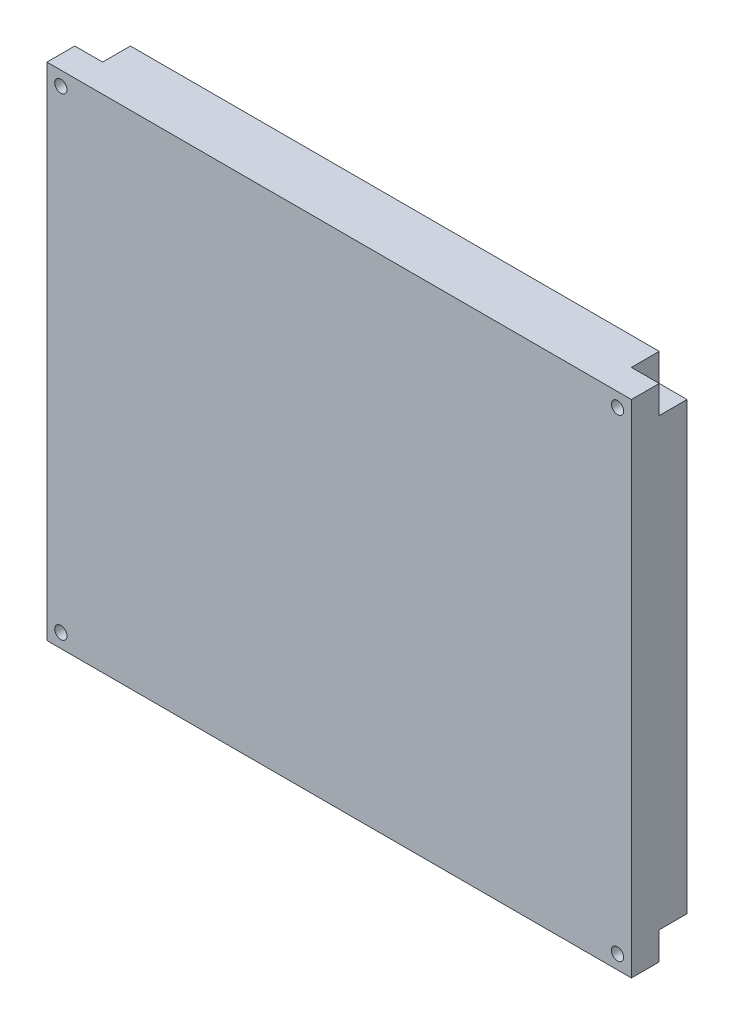
ISO-10303-21;
HEADER;
FILE_DESCRIPTION(('STEP AP214'),'2;1');
FILE_NAME('part.step','',(''),(''),'','','');
FILE_SCHEMA(('AUTOMOTIVE_DESIGN { 1 0 10303 214 1 1 1 1 }'));
ENDSEC;
DATA;
#1=APPLICATION_CONTEXT('core data for automotive mechanical design processes');
#2=APPLICATION_PROTOCOL_DEFINITION('international standard','automotive_design',2000,#1);
#3=PRODUCT_CONTEXT('',#1,'mechanical');
#4=PRODUCT('Part','Part','',(#3));
#5=PRODUCT_RELATED_PRODUCT_CATEGORY('part','',(#4));
#6=PRODUCT_DEFINITION_FORMATION('','',#4);
#7=PRODUCT_DEFINITION_CONTEXT('part definition',#1,'design');
#8=PRODUCT_DEFINITION('design','',#6,#7);
#9=PRODUCT_DEFINITION_SHAPE('','',#8);
#10=(LENGTH_UNIT() NAMED_UNIT(*) SI_UNIT(.MILLI.,.METRE.));
#11=(NAMED_UNIT(*) PLANE_ANGLE_UNIT() SI_UNIT($,.RADIAN.));
#12=(NAMED_UNIT(*) SI_UNIT($,.STERADIAN.) SOLID_ANGLE_UNIT());
#13=UNCERTAINTY_MEASURE_WITH_UNIT(LENGTH_MEASURE(1.E-05),#10,'distance_accuracy_value','');
#14=(GEOMETRIC_REPRESENTATION_CONTEXT(3) GLOBAL_UNCERTAINTY_ASSIGNED_CONTEXT((#13)) GLOBAL_UNIT_ASSIGNED_CONTEXT((#10,
#11,#12)) REPRESENTATION_CONTEXT('',''));
#15=CARTESIAN_POINT('',(0.,0.,0.));
#16=DIRECTION('',(0.,0.,1.));
#17=DIRECTION('',(1.,0.,0.));
#18=AXIS2_PLACEMENT_3D('',#15,#16,#17);
#19=CARTESIAN_POINT('',(-59.0384615384616,29.8076923076923,10.));
#20=DIRECTION('',(1.,0.,0.));
#21=DIRECTION('',(0.,1.,0.));
#22=AXIS2_PLACEMENT_3D('',#19,#20,#21);
#23=PLANE('',#22);
#24=DIRECTION('',(0.,0.,-1.));
#25=VECTOR('',#24,1.);
#26=CARTESIAN_POINT('',(-59.0384615384616,24.8076923076923,5.));
#27=LINE('',#26,#25);
#28=CARTESIAN_POINT('',(-59.0384615384616,24.8076923076923,5.));
#29=VERTEX_POINT('',#28);
#30=CARTESIAN_POINT('',(-59.0384615384616,24.8076923076923,0.));
#31=VERTEX_POINT('',#30);
#32=EDGE_CURVE('E258',#29,#31,#27,.T.);
#33=ORIENTED_EDGE('',*,*,#32,.T.);
#34=DIRECTION('',(0.,-1.,0.));
#35=VECTOR('',#34,1.);
#36=CARTESIAN_POINT('',(-59.0384615384616,29.8076923076923,0.));
#37=LINE('',#36,#35);
#38=CARTESIAN_POINT('',(-59.0384615384615,-55.1923076923077,0.));
#39=VERTEX_POINT('',#38);
#40=EDGE_CURVE('E330',#31,#39,#37,.T.);
#41=ORIENTED_EDGE('',*,*,#40,.T.);
#42=DIRECTION('',(0.,0.,-1.));
#43=VECTOR('',#42,1.);
#44=CARTESIAN_POINT('',(-59.0384615384615,-55.1923076923077,5.));
#45=LINE('',#44,#43);
#46=CARTESIAN_POINT('',(-59.0384615384615,-55.1923076923077,5.));
#47=VERTEX_POINT('',#46);
#48=EDGE_CURVE('E314',#47,#39,#45,.T.);
#49=ORIENTED_EDGE('',*,*,#48,.F.);
#50=DIRECTION('',(0.,-1.,0.));
#51=VECTOR('',#50,1.);
#52=CARTESIAN_POINT('',(-59.0384615384615,-60.1923076923077,5.));
#53=LINE('',#52,#51);
#54=CARTESIAN_POINT('',(-59.0384615384615,-60.1923076923077,5.));
#55=VERTEX_POINT('',#54);
#56=EDGE_CURVE('E299',#47,#55,#53,.T.);
#57=ORIENTED_EDGE('',*,*,#56,.T.);
#58=DIRECTION('',(0.,0.,-1.));
#59=VECTOR('',#58,1.);
#60=CARTESIAN_POINT('',(-59.0384615384615,-60.1923076923077,10.));
#61=LINE('',#60,#59);
#62=CARTESIAN_POINT('',(-59.0384615384615,-60.1923076923077,10.));
#63=VERTEX_POINT('',#62);
#64=EDGE_CURVE('E11',#63,#55,#61,.T.);
#65=ORIENTED_EDGE('',*,*,#64,.F.);
#66=DIRECTION('',(0.,-1.,0.));
#67=VECTOR('',#66,1.);
#68=CARTESIAN_POINT('',(-59.0384615384616,29.8076923076923,10.));
#69=LINE('',#68,#67);
#70=CARTESIAN_POINT('',(-59.0384615384616,29.8076923076923,10.));
#71=VERTEX_POINT('',#70);
#72=EDGE_CURVE('E331',#71,#63,#69,.T.);
#73=ORIENTED_EDGE('',*,*,#72,.F.);
#74=DIRECTION('',(0.,0.,-1.));
#75=VECTOR('',#74,1.);
#76=CARTESIAN_POINT('',(-59.0384615384616,29.8076923076923,10.));
#77=LINE('',#76,#75);
#78=CARTESIAN_POINT('',(-59.0384615384616,29.8076923076923,5.));
#79=VERTEX_POINT('',#78);
#80=EDGE_CURVE('E184',#71,#79,#77,.T.);
#81=ORIENTED_EDGE('',*,*,#80,.T.);
#82=DIRECTION('',(0.,-1.,0.));
#83=VECTOR('',#82,1.);
#84=CARTESIAN_POINT('',(-59.0384615384616,29.8076923076923,5.));
#85=LINE('',#84,#83);
#86=EDGE_CURVE('E269',#79,#29,#85,.T.);
#87=ORIENTED_EDGE('',*,*,#86,.T.);
#88=EDGE_LOOP('',(#33,#41,#49,#57,#65,#73,#81,#87));
#89=FACE_BOUND('',#88,.T.);
#90=ADVANCED_FACE('F39',(#89),#23,.F.);
#91=CARTESIAN_POINT('',(-59.0384615384615,-60.1923076923077,10.));
#92=DIRECTION('',(0.,1.,0.));
#93=DIRECTION('',(0.,0.,1.));
#94=AXIS2_PLACEMENT_3D('',#91,#92,#93);
#95=PLANE('',#94);
#96=DIRECTION('',(0.,0.,-1.));
#97=VECTOR('',#96,1.);
#98=CARTESIAN_POINT('',(40.9615384615385,-60.1923076923077,5.));
#99=LINE('',#98,#97);
#100=CARTESIAN_POINT('',(40.9615384615385,-60.1923076923077,5.));
#101=VERTEX_POINT('',#100);
#102=CARTESIAN_POINT('',(40.9615384615385,-60.1923076923077,0.));
#103=VERTEX_POINT('',#102);
#104=EDGE_CURVE('E56',#101,#103,#99,.T.);
#105=ORIENTED_EDGE('',*,*,#104,.F.);
#106=DIRECTION('',(1.,0.,0.));
#107=VECTOR('',#106,1.);
#108=CARTESIAN_POINT('',(45.9615384615385,-60.1923076923077,5.));
#109=LINE('',#108,#107);
#110=CARTESIAN_POINT('',(45.9615384615385,-60.1923076923077,5.));
#111=VERTEX_POINT('',#110);
#112=EDGE_CURVE('E161',#101,#111,#109,.T.);
#113=ORIENTED_EDGE('',*,*,#112,.T.);
#114=DIRECTION('',(0.,0.,-1.));
#115=VECTOR('',#114,1.);
#116=CARTESIAN_POINT('',(45.9615384615385,-60.1923076923077,10.));
#117=LINE('',#116,#115);
#118=CARTESIAN_POINT('',(45.9615384615385,-60.1923076923077,10.));
#119=VERTEX_POINT('',#118);
#120=EDGE_CURVE('E48',#119,#111,#117,.T.);
#121=ORIENTED_EDGE('',*,*,#120,.F.);
#122=DIRECTION('',(1.,0.,0.));
#123=VECTOR('',#122,1.);
#124=CARTESIAN_POINT('',(-59.0384615384615,-60.1923076923077,10.));
#125=LINE('',#124,#123);
#126=EDGE_CURVE('E335',#63,#119,#125,.T.);
#127=ORIENTED_EDGE('',*,*,#126,.F.);
#128=ORIENTED_EDGE('',*,*,#64,.T.);
#129=DIRECTION('',(1.,0.,0.));
#130=VECTOR('',#129,1.);
#131=CARTESIAN_POINT('',(-59.0384615384615,-60.1923076923077,5.));
#132=LINE('',#131,#130);
#133=CARTESIAN_POINT('',(-54.0384615384615,-60.1923076923077,5.));
#134=VERTEX_POINT('',#133);
#135=EDGE_CURVE('E303',#55,#134,#132,.T.);
#136=ORIENTED_EDGE('',*,*,#135,.T.);
#137=DIRECTION('',(0.,0.,-1.));
#138=VECTOR('',#137,1.);
#139=CARTESIAN_POINT('',(-54.0384615384615,-60.1923076923077,5.));
#140=LINE('',#139,#138);
#141=CARTESIAN_POINT('',(-54.0384615384615,-60.1923076923077,0.));
#142=VERTEX_POINT('',#141);
#143=EDGE_CURVE('E326',#134,#142,#140,.T.);
#144=ORIENTED_EDGE('',*,*,#143,.T.);
#145=DIRECTION('',(1.,0.,0.));
#146=VECTOR('',#145,1.);
#147=CARTESIAN_POINT('',(-59.0384615384615,-60.1923076923077,0.));
#148=LINE('',#147,#146);
#149=EDGE_CURVE('E347',#142,#103,#148,.T.);
#150=ORIENTED_EDGE('',*,*,#149,.T.);
#151=EDGE_LOOP('',(#105,#113,#121,#127,#128,#136,#144,#150));
#152=FACE_BOUND('',#151,.T.);
#153=ADVANCED_FACE('F170',(#152),#95,.F.);
#154=CARTESIAN_POINT('',(45.9615384615384,29.8076923076923,10.));
#155=DIRECTION('',(-1.,0.,0.));
#156=DIRECTION('',(0.,-1.,0.));
#157=AXIS2_PLACEMENT_3D('',#154,#155,#156);
#158=PLANE('',#157);
#159=DIRECTION('',(0.,0.,-1.));
#160=VECTOR('',#159,1.);
#161=CARTESIAN_POINT('',(45.9615384615384,24.8076923076923,5.));
#162=LINE('',#161,#160);
#163=CARTESIAN_POINT('',(45.9615384615384,24.8076923076923,5.));
#164=VERTEX_POINT('',#163);
#165=CARTESIAN_POINT('',(45.9615384615384,24.8076923076923,0.));
#166=VERTEX_POINT('',#165);
#167=EDGE_CURVE('E64',#164,#166,#162,.T.);
#168=ORIENTED_EDGE('',*,*,#167,.F.);
#169=DIRECTION('',(0.,1.,0.));
#170=VECTOR('',#169,1.);
#171=CARTESIAN_POINT('',(45.9615384615384,29.8076923076923,5.));
#172=LINE('',#171,#170);
#173=CARTESIAN_POINT('',(45.9615384615384,29.8076923076923,5.));
#174=VERTEX_POINT('',#173);
#175=EDGE_CURVE('E239',#164,#174,#172,.T.);
#176=ORIENTED_EDGE('',*,*,#175,.T.);
#177=DIRECTION('',(0.,0.,-1.));
#178=VECTOR('',#177,1.);
#179=CARTESIAN_POINT('',(45.9615384615384,29.8076923076923,10.));
#180=LINE('',#179,#178);
#181=CARTESIAN_POINT('',(45.9615384615384,29.8076923076923,10.));
#182=VERTEX_POINT('',#181);
#183=EDGE_CURVE('E180',#182,#174,#180,.T.);
#184=ORIENTED_EDGE('',*,*,#183,.F.);
#185=DIRECTION('',(0.,1.,0.));
#186=VECTOR('',#185,1.);
#187=CARTESIAN_POINT('',(45.9615384615384,29.8076923076923,10.));
#188=LINE('',#187,#186);
#189=EDGE_CURVE('E178',#119,#182,#188,.T.);
#190=ORIENTED_EDGE('',*,*,#189,.F.);
#191=ORIENTED_EDGE('',*,*,#120,.T.);
#192=DIRECTION('',(0.,1.,0.));
#193=VECTOR('',#192,1.);
#194=CARTESIAN_POINT('',(45.9615384615385,-60.1923076923077,5.));
#195=LINE('',#194,#193);
#196=CARTESIAN_POINT('',(45.9615384615385,-55.1923076923077,5.));
#197=VERTEX_POINT('',#196);
#198=EDGE_CURVE('E157',#111,#197,#195,.T.);
#199=ORIENTED_EDGE('',*,*,#198,.T.);
#200=DIRECTION('',(0.,0.,-1.));
#201=VECTOR('',#200,1.);
#202=CARTESIAN_POINT('',(45.9615384615385,-55.1923076923077,5.));
#203=LINE('',#202,#201);
#204=CARTESIAN_POINT('',(45.9615384615385,-55.1923076923077,0.));
#205=VERTEX_POINT('',#204);
#206=EDGE_CURVE('E235',#197,#205,#203,.T.);
#207=ORIENTED_EDGE('',*,*,#206,.T.);
#208=DIRECTION('',(0.,1.,0.));
#209=VECTOR('',#208,1.);
#210=CARTESIAN_POINT('',(45.9615384615384,29.8076923076923,0.));
#211=LINE('',#210,#209);
#212=EDGE_CURVE('E350',#205,#166,#211,.T.);
#213=ORIENTED_EDGE('',*,*,#212,.T.);
#214=EDGE_LOOP('',(#168,#176,#184,#190,#191,#199,#207,#213));
#215=FACE_BOUND('',#214,.T.);
#216=ADVANCED_FACE('F176',(#215),#158,.F.);
#217=CARTESIAN_POINT('',(-59.0384615384616,29.8076923076923,10.));
#218=DIRECTION('',(0.,-1.,0.));
#219=DIRECTION('',(0.,0.,-1.));
#220=AXIS2_PLACEMENT_3D('',#217,#218,#219);
#221=PLANE('',#220);
#222=DIRECTION('',(0.,0.,-1.));
#223=VECTOR('',#222,1.);
#224=CARTESIAN_POINT('',(-54.0384615384616,29.8076923076923,5.));
#225=LINE('',#224,#223);
#226=CARTESIAN_POINT('',(-54.0384615384616,29.8076923076923,5.));
#227=VERTEX_POINT('',#226);
#228=CARTESIAN_POINT('',(-54.0384615384616,29.8076923076923,0.));
#229=VERTEX_POINT('',#228);
#230=EDGE_CURVE('E284',#227,#229,#225,.T.);
#231=ORIENTED_EDGE('',*,*,#230,.F.);
#232=DIRECTION('',(-1.,0.,0.));
#233=VECTOR('',#232,1.);
#234=CARTESIAN_POINT('',(-59.0384615384616,29.8076923076923,5.));
#235=LINE('',#234,#233);
#236=EDGE_CURVE('E280',#227,#79,#235,.T.);
#237=ORIENTED_EDGE('',*,*,#236,.T.);
#238=ORIENTED_EDGE('',*,*,#80,.F.);
#239=DIRECTION('',(-1.,0.,0.));
#240=VECTOR('',#239,1.);
#241=CARTESIAN_POINT('',(-59.0384615384616,29.8076923076923,10.));
#242=LINE('',#241,#240);
#243=EDGE_CURVE('E341',#182,#71,#242,.T.);
#244=ORIENTED_EDGE('',*,*,#243,.F.);
#245=ORIENTED_EDGE('',*,*,#183,.T.);
#246=DIRECTION('',(-1.,0.,0.));
#247=VECTOR('',#246,1.);
#248=CARTESIAN_POINT('',(45.9615384615384,29.8076923076923,5.));
#249=LINE('',#248,#247);
#250=CARTESIAN_POINT('',(40.9615384615384,29.8076923076923,5.));
#251=VERTEX_POINT('',#250);
#252=EDGE_CURVE('E243',#174,#251,#249,.T.);
#253=ORIENTED_EDGE('',*,*,#252,.T.);
#254=DIRECTION('',(0.,0.,-1.));
#255=VECTOR('',#254,1.);
#256=CARTESIAN_POINT('',(40.9615384615384,29.8076923076923,5.));
#257=LINE('',#256,#255);
#258=CARTESIAN_POINT('',(40.9615384615384,29.8076923076923,0.));
#259=VERTEX_POINT('',#258);
#260=EDGE_CURVE('E227',#251,#259,#257,.T.);
#261=ORIENTED_EDGE('',*,*,#260,.T.);
#262=DIRECTION('',(-1.,0.,0.));
#263=VECTOR('',#262,1.);
#264=CARTESIAN_POINT('',(-59.0384615384616,29.8076923076923,0.));
#265=LINE('',#264,#263);
#266=EDGE_CURVE('E336',#259,#229,#265,.T.);
#267=ORIENTED_EDGE('',*,*,#266,.T.);
#268=EDGE_LOOP('',(#231,#237,#238,#244,#245,#253,#261,#267));
#269=FACE_BOUND('',#268,.T.);
#270=ADVANCED_FACE('F365',(#269),#221,.F.);
#271=CARTESIAN_POINT('',(0.,0.,0.));
#272=DIRECTION('',(0.,0.,1.));
#273=DIRECTION('',(1.,0.,0.));
#274=AXIS2_PLACEMENT_3D('',#271,#272,#273);
#275=PLANE('',#274);
#276=DIRECTION('',(1.,0.,0.));
#277=VECTOR('',#276,1.);
#278=CARTESIAN_POINT('',(-59.0384615384616,24.8076923076923,0.));
#279=LINE('',#278,#277);
#280=CARTESIAN_POINT('',(-54.0384615384616,24.8076923076923,0.));
#281=VERTEX_POINT('',#280);
#282=EDGE_CURVE('E216',#31,#281,#279,.T.);
#283=ORIENTED_EDGE('',*,*,#282,.T.);
#284=DIRECTION('',(0.,1.,0.));
#285=VECTOR('',#284,1.);
#286=CARTESIAN_POINT('',(-54.0384615384616,29.8076923076923,0.));
#287=LINE('',#286,#285);
#288=EDGE_CURVE('E274',#281,#229,#287,.T.);
#289=ORIENTED_EDGE('',*,*,#288,.T.);
#290=ORIENTED_EDGE('',*,*,#266,.F.);
#291=DIRECTION('',(0.,-1.,0.));
#292=VECTOR('',#291,1.);
#293=CARTESIAN_POINT('',(40.9615384615384,29.8076923076923,0.));
#294=LINE('',#293,#292);
#295=CARTESIAN_POINT('',(40.9615384615384,24.8076923076923,0.));
#296=VERTEX_POINT('',#295);
#297=EDGE_CURVE('E254',#259,#296,#294,.T.);
#298=ORIENTED_EDGE('',*,*,#297,.T.);
#299=DIRECTION('',(1.,0.,0.));
#300=VECTOR('',#299,1.);
#301=CARTESIAN_POINT('',(45.9615384615384,24.8076923076923,0.));
#302=LINE('',#301,#300);
#303=EDGE_CURVE('E244',#296,#166,#302,.T.);
#304=ORIENTED_EDGE('',*,*,#303,.T.);
#305=ORIENTED_EDGE('',*,*,#212,.F.);
#306=DIRECTION('',(-1.,0.,0.));
#307=VECTOR('',#306,1.);
#308=CARTESIAN_POINT('',(45.9615384615385,-55.1923076923077,0.));
#309=LINE('',#308,#307);
#310=CARTESIAN_POINT('',(40.9615384615385,-55.1923076923077,0.));
#311=VERTEX_POINT('',#310);
#312=EDGE_CURVE('E223',#205,#311,#309,.T.);
#313=ORIENTED_EDGE('',*,*,#312,.T.);
#314=DIRECTION('',(0.,-1.,0.));
#315=VECTOR('',#314,1.);
#316=CARTESIAN_POINT('',(40.9615384615385,-60.1923076923077,0.));
#317=LINE('',#316,#315);
#318=EDGE_CURVE('E174',#311,#103,#317,.T.);
#319=ORIENTED_EDGE('',*,*,#318,.T.);
#320=ORIENTED_EDGE('',*,*,#149,.F.);
#321=DIRECTION('',(0.,1.,0.));
#322=VECTOR('',#321,1.);
#323=CARTESIAN_POINT('',(-54.0384615384615,-60.1923076923077,0.));
#324=LINE('',#323,#322);
#325=CARTESIAN_POINT('',(-54.0384615384615,-55.1923076923077,0.));
#326=VERTEX_POINT('',#325);
#327=EDGE_CURVE('E238',#142,#326,#324,.T.);
#328=ORIENTED_EDGE('',*,*,#327,.T.);
#329=DIRECTION('',(-1.,0.,0.));
#330=VECTOR('',#329,1.);
#331=CARTESIAN_POINT('',(-59.0384615384615,-55.1923076923077,0.));
#332=LINE('',#331,#330);
#333=EDGE_CURVE('E304',#326,#39,#332,.T.);
#334=ORIENTED_EDGE('',*,*,#333,.T.);
#335=ORIENTED_EDGE('',*,*,#40,.F.);
#336=EDGE_LOOP('',(#283,#289,#290,#298,#304,#305,#313,#319,#320,#328,#334,#335));
#337=FACE_BOUND('',#336,.T.);
#338=ADVANCED_FACE('F377',(#337),#275,.F.);
#339=CARTESIAN_POINT('',(0.,0.,10.));
#340=DIRECTION('',(0.,0.,1.));
#341=DIRECTION('',(1.,0.,0.));
#342=AXIS2_PLACEMENT_3D('',#339,#340,#341);
#343=PLANE('',#342);
#344=CARTESIAN_POINT('',(43.4615384615385,27.3076923076922,10.));
#345=DIRECTION('',(0.,0.,1.));
#346=DIRECTION('',(1.,0.,0.));
#347=AXIS2_PLACEMENT_3D('',#344,#345,#346);
#348=CIRCLE('',#347,1.09999999999999);
#349=CARTESIAN_POINT('',(44.5615384615385,27.3076923076922,10.));
#350=VERTEX_POINT('',#349);
#351=EDGE_CURVE('E196',#350,#350,#348,.F.);
#352=ORIENTED_EDGE('',*,*,#351,.T.);
#353=EDGE_LOOP('',(#352));
#354=FACE_BOUND('',#353,.T.);
#355=CARTESIAN_POINT('',(-56.5384615384615,-57.6923076923077,10.));
#356=DIRECTION('',(0.,0.,1.));
#357=DIRECTION('',(1.,0.,0.));
#358=AXIS2_PLACEMENT_3D('',#355,#356,#357);
#359=CIRCLE('',#358,1.1);
#360=CARTESIAN_POINT('',(-55.4384615384615,-57.6923076923077,10.));
#361=VERTEX_POINT('',#360);
#362=EDGE_CURVE('E213',#361,#361,#359,.F.);
#363=ORIENTED_EDGE('',*,*,#362,.T.);
#364=EDGE_LOOP('',(#363));
#365=FACE_BOUND('',#364,.T.);
#366=CARTESIAN_POINT('',(-56.5384615384615,27.3076923076923,10.));
#367=DIRECTION('',(0.,0.,1.));
#368=DIRECTION('',(1.,0.,0.));
#369=AXIS2_PLACEMENT_3D('',#366,#367,#368);
#370=CIRCLE('',#369,1.09999999999999);
#371=CARTESIAN_POINT('',(-55.4384615384615,27.3076923076923,10.));
#372=VERTEX_POINT('',#371);
#373=EDGE_CURVE('E192',#372,#372,#370,.F.);
#374=ORIENTED_EDGE('',*,*,#373,.T.);
#375=EDGE_LOOP('',(#374));
#376=FACE_BOUND('',#375,.T.);
#377=CARTESIAN_POINT('',(43.4615384615385,-57.6923076923076,10.));
#378=DIRECTION('',(0.,0.,1.));
#379=DIRECTION('',(1.,0.,0.));
#380=AXIS2_PLACEMENT_3D('',#377,#378,#379);
#381=CIRCLE('',#380,1.1);
#382=CARTESIAN_POINT('',(44.5615384615385,-57.6923076923076,10.));
#383=VERTEX_POINT('',#382);
#384=EDGE_CURVE('E200',#383,#383,#381,.F.);
#385=ORIENTED_EDGE('',*,*,#384,.T.);
#386=EDGE_LOOP('',(#385));
#387=FACE_BOUND('',#386,.T.);
#388=ORIENTED_EDGE('',*,*,#72,.T.);
#389=ORIENTED_EDGE('',*,*,#126,.T.);
#390=ORIENTED_EDGE('',*,*,#189,.T.);
#391=ORIENTED_EDGE('',*,*,#243,.T.);
#392=EDGE_LOOP('',(#388,#389,#390,#391));
#393=FACE_BOUND('',#392,.T.);
#394=ADVANCED_FACE('F387',(#354,#365,#376,#387,#393),#343,.T.);
#395=CARTESIAN_POINT('',(-54.0384615384615,-60.1923076923077,5.));
#396=DIRECTION('',(-1.,0.,0.));
#397=DIRECTION('',(0.,0.,1.));
#398=AXIS2_PLACEMENT_3D('',#395,#396,#397);
#399=PLANE('',#398);
#400=ORIENTED_EDGE('',*,*,#327,.F.);
#401=ORIENTED_EDGE('',*,*,#143,.F.);
#402=DIRECTION('',(0.,1.,0.));
#403=VECTOR('',#402,1.);
#404=CARTESIAN_POINT('',(-54.0384615384615,-60.1923076923077,5.));
#405=LINE('',#404,#403);
#406=CARTESIAN_POINT('',(-54.0384615384615,-55.1923076923077,5.));
#407=VERTEX_POINT('',#406);
#408=EDGE_CURVE('E308',#134,#407,#405,.T.);
#409=ORIENTED_EDGE('',*,*,#408,.T.);
#410=DIRECTION('',(0.,0.,-1.));
#411=VECTOR('',#410,1.);
#412=CARTESIAN_POINT('',(-54.0384615384615,-55.1923076923077,5.));
#413=LINE('',#412,#411);
#414=EDGE_CURVE('E323',#407,#326,#413,.T.);
#415=ORIENTED_EDGE('',*,*,#414,.T.);
#416=EDGE_LOOP('',(#400,#401,#409,#415));
#417=FACE_BOUND('',#416,.T.);
#418=ADVANCED_FACE('F427',(#417),#399,.T.);
#419=CARTESIAN_POINT('',(-59.0384615384615,-55.1923076923077,5.));
#420=DIRECTION('',(0.,-1.,0.));
#421=DIRECTION('',(0.,0.,-1.));
#422=AXIS2_PLACEMENT_3D('',#419,#420,#421);
#423=PLANE('',#422);
#424=ORIENTED_EDGE('',*,*,#333,.F.);
#425=ORIENTED_EDGE('',*,*,#414,.F.);
#426=DIRECTION('',(-1.,0.,0.));
#427=VECTOR('',#426,1.);
#428=CARTESIAN_POINT('',(-59.0384615384615,-55.1923076923077,5.));
#429=LINE('',#428,#427);
#430=EDGE_CURVE('E311',#407,#47,#429,.T.);
#431=ORIENTED_EDGE('',*,*,#430,.T.);
#432=ORIENTED_EDGE('',*,*,#48,.T.);
#433=EDGE_LOOP('',(#424,#425,#431,#432));
#434=FACE_BOUND('',#433,.T.);
#435=ADVANCED_FACE('F382',(#434),#423,.T.);
#436=CARTESIAN_POINT('',(0.,0.,5.));
#437=DIRECTION('',(0.,0.,-1.));
#438=DIRECTION('',(-1.,0.,0.));
#439=AXIS2_PLACEMENT_3D('',#436,#437,#438);
#440=PLANE('',#439);
#441=CARTESIAN_POINT('',(-56.5384615384615,-57.6923076923077,5.));
#442=DIRECTION('',(0.,0.,-1.));
#443=DIRECTION('',(-1.,0.,0.));
#444=AXIS2_PLACEMENT_3D('',#441,#442,#443);
#445=CIRCLE('',#444,1.1);
#446=CARTESIAN_POINT('',(-57.6384615384615,-57.6923076923077,5.));
#447=VERTEX_POINT('',#446);
#448=EDGE_CURVE('E42',#447,#447,#445,.F.);
#449=ORIENTED_EDGE('',*,*,#448,.T.);
#450=EDGE_LOOP('',(#449));
#451=FACE_BOUND('',#450,.T.);
#452=ORIENTED_EDGE('',*,*,#56,.F.);
#453=ORIENTED_EDGE('',*,*,#430,.F.);
#454=ORIENTED_EDGE('',*,*,#408,.F.);
#455=ORIENTED_EDGE('',*,*,#135,.F.);
#456=EDGE_LOOP('',(#452,#453,#454,#455));
#457=FACE_BOUND('',#456,.T.);
#458=ADVANCED_FACE('F433',(#451,#457),#440,.T.);
#459=CARTESIAN_POINT('',(45.9615384615385,-55.1923076923077,5.));
#460=DIRECTION('',(0.,-1.,0.));
#461=DIRECTION('',(0.,0.,-1.));
#462=AXIS2_PLACEMENT_3D('',#459,#460,#461);
#463=PLANE('',#462);
#464=ORIENTED_EDGE('',*,*,#312,.F.);
#465=ORIENTED_EDGE('',*,*,#206,.F.);
#466=DIRECTION('',(-1.,0.,0.));
#467=VECTOR('',#466,1.);
#468=CARTESIAN_POINT('',(45.9615384615385,-55.1923076923077,5.));
#469=LINE('',#468,#467);
#470=CARTESIAN_POINT('',(40.9615384615385,-55.1923076923077,5.));
#471=VERTEX_POINT('',#470);
#472=EDGE_CURVE('E162',#197,#471,#469,.T.);
#473=ORIENTED_EDGE('',*,*,#472,.T.);
#474=DIRECTION('',(0.,0.,-1.));
#475=VECTOR('',#474,1.);
#476=CARTESIAN_POINT('',(40.9615384615385,-55.1923076923077,5.));
#477=LINE('',#476,#475);
#478=EDGE_CURVE('E232',#471,#311,#477,.T.);
#479=ORIENTED_EDGE('',*,*,#478,.T.);
#480=EDGE_LOOP('',(#464,#465,#473,#479));
#481=FACE_BOUND('',#480,.T.);
#482=ADVANCED_FACE('F435',(#481),#463,.T.);
#483=CARTESIAN_POINT('',(40.9615384615385,-60.1923076923077,5.));
#484=DIRECTION('',(1.,0.,0.));
#485=DIRECTION('',(0.,0.,-1.));
#486=AXIS2_PLACEMENT_3D('',#483,#484,#485);
#487=PLANE('',#486);
#488=ORIENTED_EDGE('',*,*,#318,.F.);
#489=ORIENTED_EDGE('',*,*,#478,.F.);
#490=DIRECTION('',(0.,-1.,0.));
#491=VECTOR('',#490,1.);
#492=CARTESIAN_POINT('',(40.9615384615385,-60.1923076923077,5.));
#493=LINE('',#492,#491);
#494=EDGE_CURVE('E220',#471,#101,#493,.T.);
#495=ORIENTED_EDGE('',*,*,#494,.T.);
#496=ORIENTED_EDGE('',*,*,#104,.T.);
#497=EDGE_LOOP('',(#488,#489,#495,#496));
#498=FACE_BOUND('',#497,.T.);
#499=ADVANCED_FACE('F440',(#498),#487,.T.);
#500=CARTESIAN_POINT('',(0.,0.,5.));
#501=DIRECTION('',(0.,0.,-1.));
#502=DIRECTION('',(-1.,0.,0.));
#503=AXIS2_PLACEMENT_3D('',#500,#501,#502);
#504=PLANE('',#503);
#505=CARTESIAN_POINT('',(43.4615384615385,-57.6923076923076,5.));
#506=DIRECTION('',(0.,0.,-1.));
#507=DIRECTION('',(-1.,0.,0.));
#508=AXIS2_PLACEMENT_3D('',#505,#506,#507);
#509=CIRCLE('',#508,1.1);
#510=CARTESIAN_POINT('',(42.3615384615385,-57.6923076923076,5.));
#511=VERTEX_POINT('',#510);
#512=EDGE_CURVE('E197',#511,#511,#509,.F.);
#513=ORIENTED_EDGE('',*,*,#512,.T.);
#514=EDGE_LOOP('',(#513));
#515=FACE_BOUND('',#514,.T.);
#516=ORIENTED_EDGE('',*,*,#112,.F.);
#517=ORIENTED_EDGE('',*,*,#494,.F.);
#518=ORIENTED_EDGE('',*,*,#472,.F.);
#519=ORIENTED_EDGE('',*,*,#198,.F.);
#520=EDGE_LOOP('',(#516,#517,#518,#519));
#521=FACE_BOUND('',#520,.T.);
#522=ADVANCED_FACE('F159',(#515,#521),#504,.T.);
#523=CARTESIAN_POINT('',(40.9615384615384,29.8076923076923,5.));
#524=DIRECTION('',(1.,0.,0.));
#525=DIRECTION('',(0.,0.,-1.));
#526=AXIS2_PLACEMENT_3D('',#523,#524,#525);
#527=PLANE('',#526);
#528=ORIENTED_EDGE('',*,*,#297,.F.);
#529=ORIENTED_EDGE('',*,*,#260,.F.);
#530=DIRECTION('',(0.,-1.,0.));
#531=VECTOR('',#530,1.);
#532=CARTESIAN_POINT('',(40.9615384615384,29.8076923076923,5.));
#533=LINE('',#532,#531);
#534=CARTESIAN_POINT('',(40.9615384615384,24.8076923076923,5.));
#535=VERTEX_POINT('',#534);
#536=EDGE_CURVE('E248',#251,#535,#533,.T.);
#537=ORIENTED_EDGE('',*,*,#536,.T.);
#538=DIRECTION('',(0.,0.,-1.));
#539=VECTOR('',#538,1.);
#540=CARTESIAN_POINT('',(40.9615384615384,24.8076923076923,5.));
#541=LINE('',#540,#539);
#542=EDGE_CURVE('E263',#535,#296,#541,.T.);
#543=ORIENTED_EDGE('',*,*,#542,.T.);
#544=EDGE_LOOP('',(#528,#529,#537,#543));
#545=FACE_BOUND('',#544,.T.);
#546=ADVANCED_FACE('F396',(#545),#527,.T.);
#547=CARTESIAN_POINT('',(45.9615384615384,24.8076923076923,5.));
#548=DIRECTION('',(0.,1.,0.));
#549=DIRECTION('',(0.,0.,1.));
#550=AXIS2_PLACEMENT_3D('',#547,#548,#549);
#551=PLANE('',#550);
#552=ORIENTED_EDGE('',*,*,#303,.F.);
#553=ORIENTED_EDGE('',*,*,#542,.F.);
#554=DIRECTION('',(1.,0.,0.));
#555=VECTOR('',#554,1.);
#556=CARTESIAN_POINT('',(45.9615384615384,24.8076923076923,5.));
#557=LINE('',#556,#555);
#558=EDGE_CURVE('E251',#535,#164,#557,.T.);
#559=ORIENTED_EDGE('',*,*,#558,.T.);
#560=ORIENTED_EDGE('',*,*,#167,.T.);
#561=EDGE_LOOP('',(#552,#553,#559,#560));
#562=FACE_BOUND('',#561,.T.);
#563=ADVANCED_FACE('F397',(#562),#551,.T.);
#564=CARTESIAN_POINT('',(0.,0.,5.));
#565=DIRECTION('',(0.,0.,-1.));
#566=DIRECTION('',(-1.,0.,0.));
#567=AXIS2_PLACEMENT_3D('',#564,#565,#566);
#568=PLANE('',#567);
#569=CARTESIAN_POINT('',(43.4615384615385,27.3076923076922,5.));
#570=DIRECTION('',(0.,0.,-1.));
#571=DIRECTION('',(-1.,0.,0.));
#572=AXIS2_PLACEMENT_3D('',#569,#570,#571);
#573=CIRCLE('',#572,1.09999999999999);
#574=CARTESIAN_POINT('',(42.3615384615385,27.3076923076922,5.));
#575=VERTEX_POINT('',#574);
#576=EDGE_CURVE('E193',#575,#575,#573,.F.);
#577=ORIENTED_EDGE('',*,*,#576,.T.);
#578=EDGE_LOOP('',(#577));
#579=FACE_BOUND('',#578,.T.);
#580=ORIENTED_EDGE('',*,*,#175,.F.);
#581=ORIENTED_EDGE('',*,*,#558,.F.);
#582=ORIENTED_EDGE('',*,*,#536,.F.);
#583=ORIENTED_EDGE('',*,*,#252,.F.);
#584=EDGE_LOOP('',(#580,#581,#582,#583));
#585=FACE_BOUND('',#584,.T.);
#586=ADVANCED_FACE('F392',(#579,#585),#568,.T.);
#587=CARTESIAN_POINT('',(-59.0384615384616,24.8076923076923,5.));
#588=DIRECTION('',(0.,1.,0.));
#589=DIRECTION('',(0.,0.,1.));
#590=AXIS2_PLACEMENT_3D('',#587,#588,#589);
#591=PLANE('',#590);
#592=ORIENTED_EDGE('',*,*,#282,.F.);
#593=ORIENTED_EDGE('',*,*,#32,.F.);
#594=DIRECTION('',(1.,0.,0.));
#595=VECTOR('',#594,1.);
#596=CARTESIAN_POINT('',(-59.0384615384616,24.8076923076923,5.));
#597=LINE('',#596,#595);
#598=CARTESIAN_POINT('',(-54.0384615384616,24.8076923076923,5.));
#599=VERTEX_POINT('',#598);
#600=EDGE_CURVE('E273',#29,#599,#597,.T.);
#601=ORIENTED_EDGE('',*,*,#600,.T.);
#602=DIRECTION('',(0.,0.,-1.));
#603=VECTOR('',#602,1.);
#604=CARTESIAN_POINT('',(-54.0384615384616,24.8076923076923,5.));
#605=LINE('',#604,#603);
#606=EDGE_CURVE('E293',#599,#281,#605,.T.);
#607=ORIENTED_EDGE('',*,*,#606,.T.);
#608=EDGE_LOOP('',(#592,#593,#601,#607));
#609=FACE_BOUND('',#608,.T.);
#610=ADVANCED_FACE('F373',(#609),#591,.T.);
#611=CARTESIAN_POINT('',(-54.0384615384616,29.8076923076923,5.));
#612=DIRECTION('',(-1.,0.,0.));
#613=DIRECTION('',(0.,0.,1.));
#614=AXIS2_PLACEMENT_3D('',#611,#612,#613);
#615=PLANE('',#614);
#616=ORIENTED_EDGE('',*,*,#288,.F.);
#617=ORIENTED_EDGE('',*,*,#606,.F.);
#618=DIRECTION('',(0.,1.,0.));
#619=VECTOR('',#618,1.);
#620=CARTESIAN_POINT('',(-54.0384615384616,29.8076923076923,5.));
#621=LINE('',#620,#619);
#622=EDGE_CURVE('E277',#599,#227,#621,.T.);
#623=ORIENTED_EDGE('',*,*,#622,.T.);
#624=ORIENTED_EDGE('',*,*,#230,.T.);
#625=EDGE_LOOP('',(#616,#617,#623,#624));
#626=FACE_BOUND('',#625,.T.);
#627=ADVANCED_FACE('F401',(#626),#615,.T.);
#628=CARTESIAN_POINT('',(0.,0.,5.));
#629=DIRECTION('',(0.,0.,1.));
#630=DIRECTION('',(1.,0.,0.));
#631=AXIS2_PLACEMENT_3D('',#628,#629,#630);
#632=PLANE('',#631);
#633=CARTESIAN_POINT('',(-56.5384615384615,27.3076923076923,5.));
#634=DIRECTION('',(0.,0.,1.));
#635=DIRECTION('',(1.,0.,0.));
#636=AXIS2_PLACEMENT_3D('',#633,#634,#635);
#637=CIRCLE('',#636,1.09999999999999);
#638=CARTESIAN_POINT('',(-55.4384615384615,27.3076923076923,5.));
#639=VERTEX_POINT('',#638);
#640=EDGE_CURVE('E188',#639,#639,#637,.F.);
#641=ORIENTED_EDGE('',*,*,#640,.F.);
#642=EDGE_LOOP('',(#641));
#643=FACE_BOUND('',#642,.T.);
#644=ORIENTED_EDGE('',*,*,#86,.F.);
#645=ORIENTED_EDGE('',*,*,#236,.F.);
#646=ORIENTED_EDGE('',*,*,#622,.F.);
#647=ORIENTED_EDGE('',*,*,#600,.F.);
#648=EDGE_LOOP('',(#644,#645,#646,#647));
#649=FACE_BOUND('',#648,.T.);
#650=ADVANCED_FACE('F369',(#643,#649),#632,.F.);
#651=CARTESIAN_POINT('',(-56.5384615384615,27.3076923076923,33.2));
#652=DIRECTION('',(0.,0.,-1.));
#653=DIRECTION('',(-1.,0.,0.));
#654=AXIS2_PLACEMENT_3D('',#651,#652,#653);
#655=CYLINDRICAL_SURFACE('',#654,1.09999999999999);
#656=ORIENTED_EDGE('',*,*,#373,.F.);
#657=EDGE_LOOP('',(#656));
#658=FACE_BOUND('',#657,.T.);
#659=ORIENTED_EDGE('',*,*,#640,.T.);
#660=EDGE_LOOP('',(#659));
#661=FACE_BOUND('',#660,.T.);
#662=ADVANCED_FACE('F408',(#658,#661),#655,.F.);
#663=CARTESIAN_POINT('',(43.4615384615385,27.3076923076922,33.2));
#664=DIRECTION('',(0.,0.,-1.));
#665=DIRECTION('',(-1.,0.,0.));
#666=AXIS2_PLACEMENT_3D('',#663,#664,#665);
#667=CYLINDRICAL_SURFACE('',#666,1.09999999999999);
#668=ORIENTED_EDGE('',*,*,#351,.F.);
#669=EDGE_LOOP('',(#668));
#670=FACE_BOUND('',#669,.T.);
#671=ORIENTED_EDGE('',*,*,#576,.F.);
#672=EDGE_LOOP('',(#671));
#673=FACE_BOUND('',#672,.T.);
#674=ADVANCED_FACE('F455',(#670,#673),#667,.F.);
#675=CARTESIAN_POINT('',(43.4615384615385,-57.6923076923076,33.2));
#676=DIRECTION('',(0.,0.,-1.));
#677=DIRECTION('',(-1.,0.,0.));
#678=AXIS2_PLACEMENT_3D('',#675,#676,#677);
#679=CYLINDRICAL_SURFACE('',#678,1.1);
#680=ORIENTED_EDGE('',*,*,#384,.F.);
#681=EDGE_LOOP('',(#680));
#682=FACE_BOUND('',#681,.T.);
#683=ORIENTED_EDGE('',*,*,#512,.F.);
#684=EDGE_LOOP('',(#683));
#685=FACE_BOUND('',#684,.T.);
#686=ADVANCED_FACE('F449',(#682,#685),#679,.F.);
#687=CARTESIAN_POINT('',(-56.5384615384615,-57.6923076923077,33.2));
#688=DIRECTION('',(0.,0.,-1.));
#689=DIRECTION('',(-1.,0.,0.));
#690=AXIS2_PLACEMENT_3D('',#687,#688,#689);
#691=CYLINDRICAL_SURFACE('',#690,1.1);
#692=ORIENTED_EDGE('',*,*,#362,.F.);
#693=EDGE_LOOP('',(#692));
#694=FACE_BOUND('',#693,.T.);
#695=ORIENTED_EDGE('',*,*,#448,.F.);
#696=EDGE_LOOP('',(#695));
#697=FACE_BOUND('',#696,.T.);
#698=ADVANCED_FACE('F447',(#694,#697),#691,.F.);
#699=CLOSED_SHELL('',(#90,#153,#216,#270,#338,#394,#418,#435,#458,#482,#499,#522,#546,#563,#586,
#610,#627,#650,#662,#674,#686,#698));
#700=MANIFOLD_SOLID_BREP('B2',#699);
#701=ADVANCED_BREP_SHAPE_REPRESENTATION('',(#18,#700),#14);
#702=SHAPE_DEFINITION_REPRESENTATION(#9,#701);
ENDSEC;
END-ISO-10303-21;
